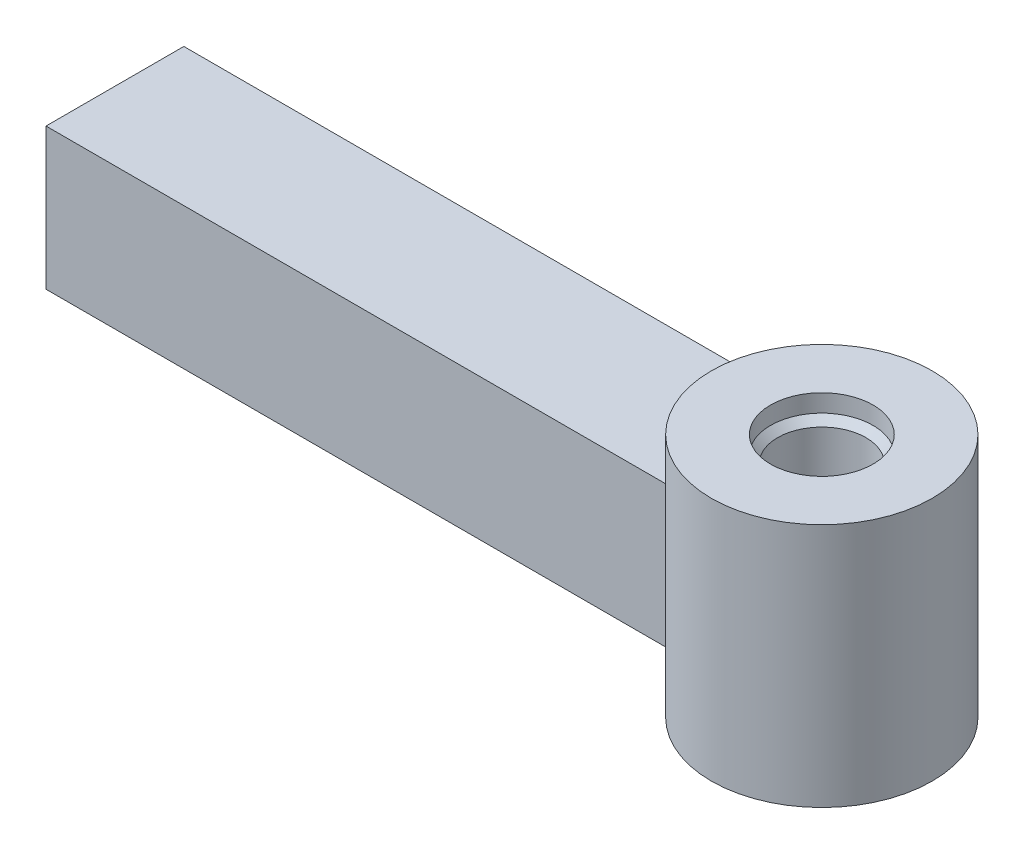
ISO-10303-21;
HEADER;
FILE_DESCRIPTION(('STEP AP214'),'2;1');
FILE_NAME('part.step','',(''),(''),'','','');
FILE_SCHEMA(('AUTOMOTIVE_DESIGN { 1 0 10303 214 1 1 1 1 }'));
ENDSEC;
DATA;
#1=APPLICATION_CONTEXT('core data for automotive mechanical design processes');
#2=APPLICATION_PROTOCOL_DEFINITION('international standard','automotive_design',2000,#1);
#3=PRODUCT_CONTEXT('',#1,'mechanical');
#4=PRODUCT('Part','Part','',(#3));
#5=PRODUCT_RELATED_PRODUCT_CATEGORY('part','',(#4));
#6=PRODUCT_DEFINITION_FORMATION('','',#4);
#7=PRODUCT_DEFINITION_CONTEXT('part definition',#1,'design');
#8=PRODUCT_DEFINITION('design','',#6,#7);
#9=PRODUCT_DEFINITION_SHAPE('','',#8);
#10=(LENGTH_UNIT() NAMED_UNIT(*) SI_UNIT(.MILLI.,.METRE.));
#11=(NAMED_UNIT(*) PLANE_ANGLE_UNIT() SI_UNIT($,.RADIAN.));
#12=(NAMED_UNIT(*) SI_UNIT($,.STERADIAN.) SOLID_ANGLE_UNIT());
#13=UNCERTAINTY_MEASURE_WITH_UNIT(LENGTH_MEASURE(1.E-05),#10,'distance_accuracy_value','');
#14=(GEOMETRIC_REPRESENTATION_CONTEXT(3) GLOBAL_UNCERTAINTY_ASSIGNED_CONTEXT((#13)) GLOBAL_UNIT_ASSIGNED_CONTEXT((#10,
#11,#12)) REPRESENTATION_CONTEXT('',''));
#15=CARTESIAN_POINT('',(0.,0.,0.));
#16=DIRECTION('',(0.,0.,1.));
#17=DIRECTION('',(1.,0.,0.));
#18=AXIS2_PLACEMENT_3D('',#15,#16,#17);
#19=CARTESIAN_POINT('',(0.,32.5217403026729,0.));
#20=DIRECTION('',(0.,-1.,0.));
#21=DIRECTION('',(0.,0.,-1.));
#22=AXIS2_PLACEMENT_3D('',#19,#20,#21);
#23=CYLINDRICAL_SURFACE('',#22,3.68300000002364);
#24=CARTESIAN_POINT('',(0.,-7.53110000005108,0.));
#25=DIRECTION('',(0.,-1.,0.));
#26=DIRECTION('',(0.,0.,-1.));
#27=AXIS2_PLACEMENT_3D('',#24,#25,#26);
#28=CIRCLE('',#27,3.68300000002364);
#29=CARTESIAN_POINT('',(0.,-7.53110000005108,-3.68300000002364));
#30=VERTEX_POINT('',#29);
#31=EDGE_CURVE('E122',#30,#30,#28,.F.);
#32=ORIENTED_EDGE('',*,*,#31,.T.);
#33=EDGE_LOOP('',(#32));
#34=FACE_BOUND('',#33,.T.);
#35=CARTESIAN_POINT('',(0.,-8.8011,0.));
#36=DIRECTION('',(0.,-1.,0.));
#37=DIRECTION('',(0.,0.,-1.));
#38=AXIS2_PLACEMENT_3D('',#35,#36,#37);
#39=CIRCLE('',#38,3.68300000002364);
#40=CARTESIAN_POINT('',(0.,-8.8011,-3.68300000002364));
#41=VERTEX_POINT('',#40);
#42=EDGE_CURVE('E165',#41,#41,#39,.F.);
#43=ORIENTED_EDGE('',*,*,#42,.F.);
#44=EDGE_LOOP('',(#43));
#45=FACE_BOUND('',#44,.T.);
#46=ADVANCED_FACE('F41',(#34,#45),#23,.F.);
#47=CARTESIAN_POINT('',(0.,32.5217403026729,0.));
#48=DIRECTION('',(0.,-1.,0.));
#49=DIRECTION('',(0.,0.,-1.));
#50=AXIS2_PLACEMENT_3D('',#47,#48,#49);
#51=CYLINDRICAL_SURFACE('',#50,7.9375);
#52=CARTESIAN_POINT('',(0.,5.08,0.));
#53=DIRECTION('',(0.,1.,0.));
#54=DIRECTION('',(0.,0.,1.));
#55=AXIS2_PLACEMENT_3D('',#52,#53,#54);
#56=CIRCLE('',#55,7.9375);
#57=CARTESIAN_POINT('',(-6.2025557030953,5.08,4.953));
#58=VERTEX_POINT('',#57);
#59=CARTESIAN_POINT('',(-6.2025557030953,5.08,-4.953));
#60=VERTEX_POINT('',#59);
#61=EDGE_CURVE('E56',#58,#60,#56,.F.);
#62=ORIENTED_EDGE('',*,*,#61,.F.);
#63=DIRECTION('',(0.,-1.,0.));
#64=VECTOR('',#63,1.);
#65=CARTESIAN_POINT('',(-6.2025557030953,32.5217403026729,4.953));
#66=LINE('',#65,#64);
#67=CARTESIAN_POINT('',(-6.2025557030953,-5.08,4.953));
#68=VERTEX_POINT('',#67);
#69=EDGE_CURVE('E64',#68,#58,#66,.F.);
#70=ORIENTED_EDGE('',*,*,#69,.F.);
#71=CARTESIAN_POINT('',(0.,-5.08,0.));
#72=DIRECTION('',(0.,1.,0.));
#73=DIRECTION('',(0.,0.,1.));
#74=AXIS2_PLACEMENT_3D('',#71,#72,#73);
#75=CIRCLE('',#74,7.9375);
#76=CARTESIAN_POINT('',(-6.2025557030953,-5.08,-4.953));
#77=VERTEX_POINT('',#76);
#78=EDGE_CURVE('E12',#68,#77,#75,.F.);
#79=ORIENTED_EDGE('',*,*,#78,.T.);
#80=DIRECTION('',(0.,-1.,0.));
#81=VECTOR('',#80,1.);
#82=CARTESIAN_POINT('',(-6.2025557030953,32.5217403026729,-4.953));
#83=LINE('',#82,#81);
#84=EDGE_CURVE('E93',#60,#77,#83,.T.);
#85=ORIENTED_EDGE('',*,*,#84,.F.);
#86=EDGE_LOOP('',(#62,#70,#79,#85));
#87=FACE_BOUND('',#86,.T.);
#88=CARTESIAN_POINT('',(0.,8.8011,0.));
#89=DIRECTION('',(0.,1.,0.));
#90=DIRECTION('',(0.,0.,1.));
#91=AXIS2_PLACEMENT_3D('',#88,#89,#90);
#92=CIRCLE('',#91,7.9375);
#93=CARTESIAN_POINT('',(0.,8.8011,7.9375));
#94=VERTEX_POINT('',#93);
#95=EDGE_CURVE('E97',#94,#94,#92,.T.);
#96=ORIENTED_EDGE('',*,*,#95,.F.);
#97=EDGE_LOOP('',(#96));
#98=FACE_BOUND('',#97,.T.);
#99=CARTESIAN_POINT('',(0.,-8.8011,0.));
#100=DIRECTION('',(0.,-1.,0.));
#101=DIRECTION('',(0.,0.,-1.));
#102=AXIS2_PLACEMENT_3D('',#99,#100,#101);
#103=CIRCLE('',#102,7.9375);
#104=CARTESIAN_POINT('',(0.,-8.8011,-7.9375));
#105=VERTEX_POINT('',#104);
#106=EDGE_CURVE('E169',#105,#105,#103,.F.);
#107=ORIENTED_EDGE('',*,*,#106,.T.);
#108=EDGE_LOOP('',(#107));
#109=FACE_BOUND('',#108,.T.);
#110=ADVANCED_FACE('F99',(#87,#98,#109),#51,.T.);
#111=CARTESIAN_POINT('',(0.,7.53110000005108,0.));
#112=DIRECTION('',(0.,1.,0.));
#113=DIRECTION('',(-1.,0.,0.));
#114=AXIS2_PLACEMENT_3D('',#111,#112,#113);
#115=CIRCLE('',#114,3.68300000002364);
#116=CARTESIAN_POINT('',(-3.68300000002364,7.53110000005108,0.));
#117=VERTEX_POINT('',#116);
#118=EDGE_CURVE('E49',#117,#117,#115,.F.);
#119=ORIENTED_EDGE('',*,*,#118,.T.);
#120=EDGE_LOOP('',(#119));
#121=FACE_BOUND('',#120,.T.);
#122=CARTESIAN_POINT('',(0.,8.8011,0.));
#123=DIRECTION('',(0.,1.,0.));
#124=DIRECTION('',(0.,0.,1.));
#125=AXIS2_PLACEMENT_3D('',#122,#123,#124);
#126=CIRCLE('',#125,3.68300000002364);
#127=CARTESIAN_POINT('',(0.,8.8011,3.68300000002364));
#128=VERTEX_POINT('',#127);
#129=EDGE_CURVE('E164',#128,#128,#126,.T.);
#130=ORIENTED_EDGE('',*,*,#129,.T.);
#131=EDGE_LOOP('',(#130));
#132=FACE_BOUND('',#131,.T.);
#133=ADVANCED_FACE('F146',(#121,#132),#23,.F.);
#134=CARTESIAN_POINT('',(0.,8.8011,0.));
#135=DIRECTION('',(0.,1.,0.));
#136=DIRECTION('',(0.,0.,1.));
#137=AXIS2_PLACEMENT_3D('',#134,#135,#136);
#138=PLANE('',#137);
#139=ORIENTED_EDGE('',*,*,#129,.F.);
#140=EDGE_LOOP('',(#139));
#141=FACE_BOUND('',#140,.T.);
#142=ORIENTED_EDGE('',*,*,#95,.T.);
#143=EDGE_LOOP('',(#142));
#144=FACE_BOUND('',#143,.T.);
#145=ADVANCED_FACE('F153',(#141,#144),#138,.T.);
#146=CARTESIAN_POINT('',(0.,-8.8011,0.));
#147=DIRECTION('',(0.,-1.,0.));
#148=DIRECTION('',(0.,0.,-1.));
#149=AXIS2_PLACEMENT_3D('',#146,#147,#148);
#150=PLANE('',#149);
#151=ORIENTED_EDGE('',*,*,#106,.F.);
#152=EDGE_LOOP('',(#151));
#153=FACE_BOUND('',#152,.T.);
#154=ORIENTED_EDGE('',*,*,#42,.T.);
#155=EDGE_LOOP('',(#154));
#156=FACE_BOUND('',#155,.T.);
#157=ADVANCED_FACE('F158',(#153,#156),#150,.T.);
#158=CARTESIAN_POINT('',(-50.8,5.08,0.));
#159=DIRECTION('',(-1.,0.,0.));
#160=DIRECTION('',(0.,0.,1.));
#161=AXIS2_PLACEMENT_3D('',#158,#159,#160);
#162=PLANE('',#161);
#163=DIRECTION('',(0.,-1.,0.));
#164=VECTOR('',#163,1.);
#165=CARTESIAN_POINT('',(-50.8,5.08,-4.953));
#166=LINE('',#165,#164);
#167=CARTESIAN_POINT('',(-50.8,5.08,-4.953));
#168=VERTEX_POINT('',#167);
#169=CARTESIAN_POINT('',(-50.8,-5.08,-4.953));
#170=VERTEX_POINT('',#169);
#171=EDGE_CURVE('E116',#168,#170,#166,.T.);
#172=ORIENTED_EDGE('',*,*,#171,.T.);
#173=DIRECTION('',(0.,0.,-1.));
#174=VECTOR('',#173,1.);
#175=CARTESIAN_POINT('',(-50.8,-5.08,0.));
#176=LINE('',#175,#174);
#177=CARTESIAN_POINT('',(-50.8,-5.08,4.953));
#178=VERTEX_POINT('',#177);
#179=EDGE_CURVE('E88',#178,#170,#176,.T.);
#180=ORIENTED_EDGE('',*,*,#179,.F.);
#181=DIRECTION('',(0.,-1.,0.));
#182=VECTOR('',#181,1.);
#183=CARTESIAN_POINT('',(-50.8,5.08,4.953));
#184=LINE('',#183,#182);
#185=CARTESIAN_POINT('',(-50.8,5.08,4.953));
#186=VERTEX_POINT('',#185);
#187=EDGE_CURVE('E113',#186,#178,#184,.T.);
#188=ORIENTED_EDGE('',*,*,#187,.F.);
#189=DIRECTION('',(0.,0.,-1.));
#190=VECTOR('',#189,1.);
#191=CARTESIAN_POINT('',(-50.8,5.08,0.));
#192=LINE('',#191,#190);
#193=EDGE_CURVE('E110',#186,#168,#192,.T.);
#194=ORIENTED_EDGE('',*,*,#193,.T.);
#195=EDGE_LOOP('',(#172,#180,#188,#194));
#196=FACE_BOUND('',#195,.T.);
#197=ADVANCED_FACE('F178',(#196),#162,.T.);
#198=CARTESIAN_POINT('',(0.,-5.08,0.));
#199=DIRECTION('',(0.,1.,0.));
#200=DIRECTION('',(0.,0.,1.));
#201=AXIS2_PLACEMENT_3D('',#198,#199,#200);
#202=PLANE('',#201);
#203=ORIENTED_EDGE('',*,*,#78,.F.);
#204=DIRECTION('',(-1.,0.,0.));
#205=VECTOR('',#204,1.);
#206=CARTESIAN_POINT('',(0.,-5.08,4.953));
#207=LINE('',#206,#205);
#208=EDGE_CURVE('E90',#68,#178,#207,.T.);
#209=ORIENTED_EDGE('',*,*,#208,.T.);
#210=ORIENTED_EDGE('',*,*,#179,.T.);
#211=DIRECTION('',(1.,0.,0.));
#212=VECTOR('',#211,1.);
#213=CARTESIAN_POINT('',(0.,-5.08,-4.953));
#214=LINE('',#213,#212);
#215=EDGE_CURVE('E84',#170,#77,#214,.T.);
#216=ORIENTED_EDGE('',*,*,#215,.T.);
#217=EDGE_LOOP('',(#203,#209,#210,#216));
#218=FACE_BOUND('',#217,.T.);
#219=ADVANCED_FACE('F86',(#218),#202,.F.);
#220=CARTESIAN_POINT('',(0.,5.08,0.));
#221=DIRECTION('',(0.,1.,0.));
#222=DIRECTION('',(0.,0.,1.));
#223=AXIS2_PLACEMENT_3D('',#220,#221,#222);
#224=PLANE('',#223);
#225=DIRECTION('',(-1.,0.,0.));
#226=VECTOR('',#225,1.);
#227=CARTESIAN_POINT('',(0.,5.08,4.953));
#228=LINE('',#227,#226);
#229=EDGE_CURVE('E107',#58,#186,#228,.T.);
#230=ORIENTED_EDGE('',*,*,#229,.F.);
#231=ORIENTED_EDGE('',*,*,#61,.T.);
#232=DIRECTION('',(1.,0.,0.));
#233=VECTOR('',#232,1.);
#234=CARTESIAN_POINT('',(0.,5.08,-4.953));
#235=LINE('',#234,#233);
#236=EDGE_CURVE('E95',#168,#60,#235,.T.);
#237=ORIENTED_EDGE('',*,*,#236,.F.);
#238=ORIENTED_EDGE('',*,*,#193,.F.);
#239=EDGE_LOOP('',(#230,#231,#237,#238));
#240=FACE_BOUND('',#239,.T.);
#241=ADVANCED_FACE('F189',(#240),#224,.T.);
#242=CARTESIAN_POINT('',(0.,5.08,-4.953));
#243=DIRECTION('',(0.,0.,-1.));
#244=DIRECTION('',(-1.,0.,0.));
#245=AXIS2_PLACEMENT_3D('',#242,#243,#244);
#246=PLANE('',#245);
#247=ORIENTED_EDGE('',*,*,#236,.T.);
#248=ORIENTED_EDGE('',*,*,#84,.T.);
#249=ORIENTED_EDGE('',*,*,#215,.F.);
#250=ORIENTED_EDGE('',*,*,#171,.F.);
#251=EDGE_LOOP('',(#247,#248,#249,#250));
#252=FACE_BOUND('',#251,.T.);
#253=ADVANCED_FACE('F94',(#252),#246,.T.);
#254=CARTESIAN_POINT('',(0.,5.08,4.953));
#255=DIRECTION('',(0.,0.,1.));
#256=DIRECTION('',(1.,0.,0.));
#257=AXIS2_PLACEMENT_3D('',#254,#255,#256);
#258=PLANE('',#257);
#259=ORIENTED_EDGE('',*,*,#208,.F.);
#260=ORIENTED_EDGE('',*,*,#69,.T.);
#261=ORIENTED_EDGE('',*,*,#229,.T.);
#262=ORIENTED_EDGE('',*,*,#187,.T.);
#263=EDGE_LOOP('',(#259,#260,#261,#262));
#264=FACE_BOUND('',#263,.T.);
#265=ADVANCED_FACE('F138',(#264),#258,.T.);
#266=CARTESIAN_POINT('',(0.,0.,0.));
#267=DIRECTION('',(0.,1.,0.));
#268=DIRECTION('',(0.,0.,1.));
#269=AXIS2_PLACEMENT_3D('',#266,#267,#268);
#270=CYLINDRICAL_SURFACE('',#269,3.175);
#271=CARTESIAN_POINT('',(0.,7.02310000002626,0.));
#272=DIRECTION('',(0.,1.,0.));
#273=DIRECTION('',(0.,0.,-1.));
#274=AXIS2_PLACEMENT_3D('',#271,#272,#273);
#275=CIRCLE('',#274,3.17499999999882);
#276=CARTESIAN_POINT('',(0.,7.02310000002626,-3.17499999999882));
#277=VERTEX_POINT('',#276);
#278=EDGE_CURVE('E119',#277,#277,#275,.T.);
#279=ORIENTED_EDGE('',*,*,#278,.T.);
#280=EDGE_LOOP('',(#279));
#281=FACE_BOUND('',#280,.T.);
#282=CARTESIAN_POINT('',(0.,-7.02310000002626,0.));
#283=DIRECTION('',(0.,-1.,0.));
#284=DIRECTION('',(0.,0.,-1.));
#285=AXIS2_PLACEMENT_3D('',#282,#283,#284);
#286=CIRCLE('',#285,3.17499999999882);
#287=CARTESIAN_POINT('',(0.,-7.02310000002626,-3.17499999999882));
#288=VERTEX_POINT('',#287);
#289=EDGE_CURVE('E118',#288,#288,#286,.T.);
#290=ORIENTED_EDGE('',*,*,#289,.T.);
#291=EDGE_LOOP('',(#290));
#292=FACE_BOUND('',#291,.T.);
#293=ADVANCED_FACE('F43',(#281,#292),#270,.F.);
#294=CARTESIAN_POINT('',(0.,-7.53110000010793,0.));
#295=DIRECTION('',(0.,-1.,0.));
#296=DIRECTION('',(0.,0.,-1.));
#297=AXIS2_PLACEMENT_3D('',#294,#295,#296);
#298=CONICAL_SURFACE('',#297,3.68300000008048,0.785398163397448);
#299=ORIENTED_EDGE('',*,*,#31,.F.);
#300=EDGE_LOOP('',(#299));
#301=FACE_BOUND('',#300,.T.);
#302=ORIENTED_EDGE('',*,*,#289,.F.);
#303=EDGE_LOOP('',(#302));
#304=FACE_BOUND('',#303,.T.);
#305=ADVANCED_FACE('F131',(#301,#304),#298,.F.);
#306=CARTESIAN_POINT('',(0.,7.53110000010793,0.));
#307=DIRECTION('',(0.,1.,0.));
#308=DIRECTION('',(-1.,0.,0.));
#309=AXIS2_PLACEMENT_3D('',#306,#307,#308);
#310=CONICAL_SURFACE('',#309,3.68300000008048,0.785398163397448);
#311=ORIENTED_EDGE('',*,*,#118,.F.);
#312=EDGE_LOOP('',(#311));
#313=FACE_BOUND('',#312,.T.);
#314=ORIENTED_EDGE('',*,*,#278,.F.);
#315=EDGE_LOOP('',(#314));
#316=FACE_BOUND('',#315,.T.);
#317=ADVANCED_FACE('F134',(#313,#316),#310,.F.);
#318=CLOSED_SHELL('',(#46,#110,#133,#145,#157,#197,#219,#241,#253,#265,#293,#305,#317));
#319=MANIFOLD_SOLID_BREP('B2',#318);
#320=ADVANCED_BREP_SHAPE_REPRESENTATION('',(#18,#319),#14);
#321=SHAPE_DEFINITION_REPRESENTATION(#9,#320);
ENDSEC;
END-ISO-10303-21;
